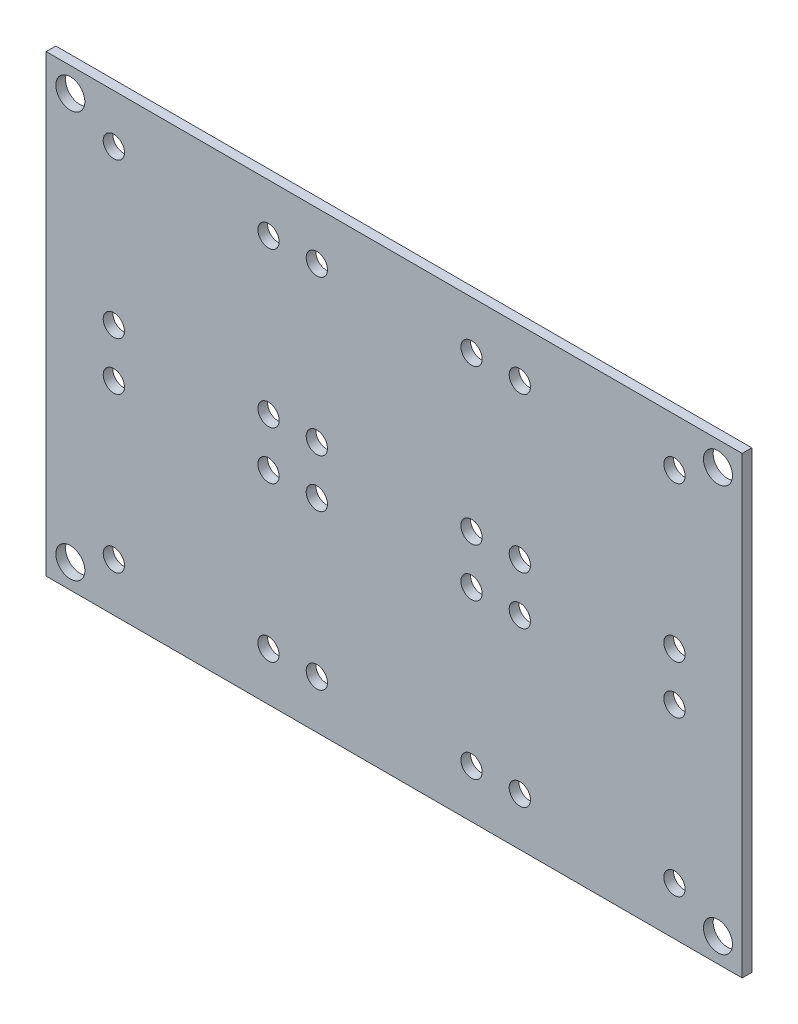
ISO-10303-21;
HEADER;
FILE_DESCRIPTION(('STEP AP214'),'2;1');
FILE_NAME('part.step','',(''),(''),'','','');
FILE_SCHEMA(('AUTOMOTIVE_DESIGN { 1 0 10303 214 1 1 1 1 }'));
ENDSEC;
DATA;
#1=APPLICATION_CONTEXT('core data for automotive mechanical design processes');
#2=APPLICATION_PROTOCOL_DEFINITION('international standard','automotive_design',2000,#1);
#3=PRODUCT_CONTEXT('',#1,'mechanical');
#4=PRODUCT('Part','Part','',(#3));
#5=PRODUCT_RELATED_PRODUCT_CATEGORY('part','',(#4));
#6=PRODUCT_DEFINITION_FORMATION('','',#4);
#7=PRODUCT_DEFINITION_CONTEXT('part definition',#1,'design');
#8=PRODUCT_DEFINITION('design','',#6,#7);
#9=PRODUCT_DEFINITION_SHAPE('','',#8);
#10=(LENGTH_UNIT() NAMED_UNIT(*) SI_UNIT(.MILLI.,.METRE.));
#11=(NAMED_UNIT(*) PLANE_ANGLE_UNIT() SI_UNIT($,.RADIAN.));
#12=(NAMED_UNIT(*) SI_UNIT($,.STERADIAN.) SOLID_ANGLE_UNIT());
#13=UNCERTAINTY_MEASURE_WITH_UNIT(LENGTH_MEASURE(1.E-05),#10,'distance_accuracy_value','');
#14=(GEOMETRIC_REPRESENTATION_CONTEXT(3) GLOBAL_UNCERTAINTY_ASSIGNED_CONTEXT((#13)) GLOBAL_UNIT_ASSIGNED_CONTEXT((#10,
#11,#12)) REPRESENTATION_CONTEXT('',''));
#15=CARTESIAN_POINT('',(0.,0.,0.));
#16=DIRECTION('',(0.,0.,1.));
#17=DIRECTION('',(1.,0.,0.));
#18=AXIS2_PLACEMENT_3D('',#15,#16,#17);
#19=CARTESIAN_POINT('',(-78.4654545454545,41.4428806133625,1.00000000000004));
#20=DIRECTION('',(1.,0.,0.));
#21=DIRECTION('',(0.,1.,0.));
#22=AXIS2_PLACEMENT_3D('',#19,#20,#21);
#23=PLANE('',#22);
#24=DIRECTION('',(0.,-1.,0.));
#25=VECTOR('',#24,1.);
#26=CARTESIAN_POINT('',(-78.4654545454545,41.4428806133625,0.));
#27=LINE('',#26,#25);
#28=CARTESIAN_POINT('',(-78.4654545454545,41.4428806133625,0.));
#29=VERTEX_POINT('',#28);
#30=CARTESIAN_POINT('',(-78.4654545454545,-5.55711938663746,0.));
#31=VERTEX_POINT('',#30);
#32=EDGE_CURVE('E96',#29,#31,#27,.T.);
#33=ORIENTED_EDGE('',*,*,#32,.T.);
#34=DIRECTION('',(0.,0.,-1.));
#35=VECTOR('',#34,1.);
#36=CARTESIAN_POINT('',(-78.4654545454545,-5.55711938663746,1.00000000000004));
#37=LINE('',#36,#35);
#38=CARTESIAN_POINT('',(-78.4654545454545,-5.55711938663746,1.00000000000004));
#39=VERTEX_POINT('',#38);
#40=EDGE_CURVE('E11',#39,#31,#37,.T.);
#41=ORIENTED_EDGE('',*,*,#40,.F.);
#42=DIRECTION('',(0.,-1.,0.));
#43=VECTOR('',#42,1.);
#44=CARTESIAN_POINT('',(-78.4654545454545,41.4428806133625,1.00000000000004));
#45=LINE('',#44,#43);
#46=CARTESIAN_POINT('',(-78.4654545454545,41.4428806133625,1.00000000000004));
#47=VERTEX_POINT('',#46);
#48=EDGE_CURVE('E84',#47,#39,#45,.T.);
#49=ORIENTED_EDGE('',*,*,#48,.F.);
#50=DIRECTION('',(0.,0.,-1.));
#51=VECTOR('',#50,1.);
#52=CARTESIAN_POINT('',(-78.4654545454545,41.4428806133625,1.00000000000004));
#53=LINE('',#52,#51);
#54=EDGE_CURVE('E92',#47,#29,#53,.T.);
#55=ORIENTED_EDGE('',*,*,#54,.T.);
#56=EDGE_LOOP('',(#33,#41,#49,#55));
#57=FACE_BOUND('',#56,.T.);
#58=ADVANCED_FACE('F33',(#57),#23,.F.);
#59=CARTESIAN_POINT('',(-78.4654545454545,-5.55711938663746,1.00000000000004));
#60=DIRECTION('',(0.,1.,0.));
#61=DIRECTION('',(0.,0.,1.));
#62=AXIS2_PLACEMENT_3D('',#59,#60,#61);
#63=PLANE('',#62);
#64=DIRECTION('',(1.,0.,0.));
#65=VECTOR('',#64,1.);
#66=CARTESIAN_POINT('',(-78.4654545454545,-5.55711938663746,0.));
#67=LINE('',#66,#65);
#68=CARTESIAN_POINT('',(-6.46545454545452,-5.55711938663746,0.));
#69=VERTEX_POINT('',#68);
#70=EDGE_CURVE('E88',#31,#69,#67,.T.);
#71=ORIENTED_EDGE('',*,*,#70,.T.);
#72=DIRECTION('',(0.,0.,-1.));
#73=VECTOR('',#72,1.);
#74=CARTESIAN_POINT('',(-6.46545454545452,-5.55711938663746,1.00000000000004));
#75=LINE('',#74,#73);
#76=CARTESIAN_POINT('',(-6.46545454545452,-5.55711938663746,1.00000000000004));
#77=VERTEX_POINT('',#76);
#78=EDGE_CURVE('E41',#77,#69,#75,.T.);
#79=ORIENTED_EDGE('',*,*,#78,.F.);
#80=DIRECTION('',(1.,0.,0.));
#81=VECTOR('',#80,1.);
#82=CARTESIAN_POINT('',(-78.4654545454545,-5.55711938663746,1.00000000000004));
#83=LINE('',#82,#81);
#84=EDGE_CURVE('E79',#39,#77,#83,.T.);
#85=ORIENTED_EDGE('',*,*,#84,.F.);
#86=ORIENTED_EDGE('',*,*,#40,.T.);
#87=EDGE_LOOP('',(#71,#79,#85,#86));
#88=FACE_BOUND('',#87,.T.);
#89=ADVANCED_FACE('F87',(#88),#63,.F.);
#90=CARTESIAN_POINT('',(-6.46545454545452,41.4428806133625,1.00000000000004));
#91=DIRECTION('',(-1.,0.,0.));
#92=DIRECTION('',(0.,0.,1.));
#93=AXIS2_PLACEMENT_3D('',#90,#91,#92);
#94=PLANE('',#93);
#95=DIRECTION('',(0.,1.,0.));
#96=VECTOR('',#95,1.);
#97=CARTESIAN_POINT('',(-6.46545454545452,41.4428806133625,0.));
#98=LINE('',#97,#96);
#99=CARTESIAN_POINT('',(-6.46545454545452,41.4428806133625,0.));
#100=VERTEX_POINT('',#99);
#101=EDGE_CURVE('E66',#69,#100,#98,.T.);
#102=ORIENTED_EDGE('',*,*,#101,.T.);
#103=DIRECTION('',(0.,0.,-1.));
#104=VECTOR('',#103,1.);
#105=CARTESIAN_POINT('',(-6.46545454545452,41.4428806133625,1.00000000000004));
#106=LINE('',#105,#104);
#107=CARTESIAN_POINT('',(-6.46545454545452,41.4428806133625,1.00000000000004));
#108=VERTEX_POINT('',#107);
#109=EDGE_CURVE('E89',#108,#100,#106,.T.);
#110=ORIENTED_EDGE('',*,*,#109,.F.);
#111=DIRECTION('',(0.,1.,0.));
#112=VECTOR('',#111,1.);
#113=CARTESIAN_POINT('',(-6.46545454545452,41.4428806133625,1.00000000000004));
#114=LINE('',#113,#112);
#115=EDGE_CURVE('E82',#77,#108,#114,.T.);
#116=ORIENTED_EDGE('',*,*,#115,.F.);
#117=ORIENTED_EDGE('',*,*,#78,.T.);
#118=EDGE_LOOP('',(#102,#110,#116,#117));
#119=FACE_BOUND('',#118,.T.);
#120=ADVANCED_FACE('F90',(#119),#94,.F.);
#121=CARTESIAN_POINT('',(-78.4654545454545,41.4428806133625,1.00000000000004));
#122=DIRECTION('',(0.,-1.,0.));
#123=DIRECTION('',(0.,0.,-1.));
#124=AXIS2_PLACEMENT_3D('',#121,#122,#123);
#125=PLANE('',#124);
#126=DIRECTION('',(-1.,0.,0.));
#127=VECTOR('',#126,1.);
#128=CARTESIAN_POINT('',(-78.4654545454545,41.4428806133625,0.));
#129=LINE('',#128,#127);
#130=EDGE_CURVE('E72',#100,#29,#129,.T.);
#131=ORIENTED_EDGE('',*,*,#130,.T.);
#132=ORIENTED_EDGE('',*,*,#54,.F.);
#133=DIRECTION('',(-1.,0.,0.));
#134=VECTOR('',#133,1.);
#135=CARTESIAN_POINT('',(-78.4654545454545,41.4428806133625,1.00000000000004));
#136=LINE('',#135,#134);
#137=EDGE_CURVE('E49',#108,#47,#136,.T.);
#138=ORIENTED_EDGE('',*,*,#137,.F.);
#139=ORIENTED_EDGE('',*,*,#109,.T.);
#140=EDGE_LOOP('',(#131,#132,#138,#139));
#141=FACE_BOUND('',#140,.T.);
#142=ADVANCED_FACE('F104',(#141),#125,.F.);
#143=CARTESIAN_POINT('',(-6.46545454545452,-5.55711938663746,1.00000000000004));
#144=DIRECTION('',(0.,0.,1.));
#145=DIRECTION('',(1.,0.,0.));
#146=AXIS2_PLACEMENT_3D('',#143,#144,#145);
#147=PLANE('',#146);
#148=CARTESIAN_POINT('',(-71.4654545454543,15.4428806133625,1.00000000000004));
#149=DIRECTION('',(0.,0.,1.));
#150=DIRECTION('',(1.,0.,0.));
#151=AXIS2_PLACEMENT_3D('',#148,#149,#150);
#152=CIRCLE('',#151,1.10000000000001);
#153=CARTESIAN_POINT('',(-70.3654545454543,15.4428806133625,1.00000000000004));
#154=VERTEX_POINT('',#153);
#155=EDGE_CURVE('E200',#154,#154,#152,.T.);
#156=ORIENTED_EDGE('',*,*,#155,.F.);
#157=EDGE_LOOP('',(#156));
#158=FACE_BOUND('',#157,.T.);
#159=CARTESIAN_POINT('',(-13.4654545454543,20.4428806133625,1.00000000000004));
#160=DIRECTION('',(0.,0.,1.));
#161=DIRECTION('',(1.,0.,0.));
#162=AXIS2_PLACEMENT_3D('',#159,#160,#161);
#163=CIRCLE('',#162,1.10000000000001);
#164=CARTESIAN_POINT('',(-12.3654545454543,20.4428806133625,1.00000000000004));
#165=VERTEX_POINT('',#164);
#166=EDGE_CURVE('E207',#165,#165,#163,.T.);
#167=ORIENTED_EDGE('',*,*,#166,.F.);
#168=EDGE_LOOP('',(#167));
#169=FACE_BOUND('',#168,.T.);
#170=CARTESIAN_POINT('',(-29.4654545454543,20.4428806133625,1.00000000000004));
#171=DIRECTION('',(0.,0.,1.));
#172=DIRECTION('',(1.,0.,0.));
#173=AXIS2_PLACEMENT_3D('',#170,#171,#172);
#174=CIRCLE('',#173,1.10000000000001);
#175=CARTESIAN_POINT('',(-28.3654545454543,20.4428806133625,1.00000000000004));
#176=VERTEX_POINT('',#175);
#177=EDGE_CURVE('E188',#176,#176,#174,.T.);
#178=ORIENTED_EDGE('',*,*,#177,.F.);
#179=EDGE_LOOP('',(#178));
#180=FACE_BOUND('',#179,.T.);
#181=CARTESIAN_POINT('',(-34.4654545454543,20.4428806133625,1.00000000000004));
#182=DIRECTION('',(0.,0.,1.));
#183=DIRECTION('',(1.,0.,0.));
#184=AXIS2_PLACEMENT_3D('',#181,#182,#183);
#185=CIRCLE('',#184,1.10000000000001);
#186=CARTESIAN_POINT('',(-33.3654545454543,20.4428806133625,1.00000000000004));
#187=VERTEX_POINT('',#186);
#188=EDGE_CURVE('E195',#187,#187,#185,.T.);
#189=ORIENTED_EDGE('',*,*,#188,.F.);
#190=EDGE_LOOP('',(#189));
#191=FACE_BOUND('',#190,.T.);
#192=CARTESIAN_POINT('',(-50.4654545454543,15.4428806133625,1.00000000000004));
#193=DIRECTION('',(0.,0.,1.));
#194=DIRECTION('',(1.,0.,0.));
#195=AXIS2_PLACEMENT_3D('',#192,#193,#194);
#196=CIRCLE('',#195,1.10000000000001);
#197=CARTESIAN_POINT('',(-49.3654545454543,15.4428806133625,1.00000000000004));
#198=VERTEX_POINT('',#197);
#199=EDGE_CURVE('E224',#198,#198,#196,.T.);
#200=ORIENTED_EDGE('',*,*,#199,.F.);
#201=EDGE_LOOP('',(#200));
#202=FACE_BOUND('',#201,.T.);
#203=CARTESIAN_POINT('',(-55.4654545454541,-0.557119386637463,1.00000000000004));
#204=DIRECTION('',(0.,0.,1.));
#205=DIRECTION('',(1.,0.,0.));
#206=AXIS2_PLACEMENT_3D('',#203,#204,#205);
#207=CIRCLE('',#206,1.10000000000001);
#208=CARTESIAN_POINT('',(-54.3654545454541,-0.557119386637463,1.00000000000004));
#209=VERTEX_POINT('',#208);
#210=EDGE_CURVE('E231',#209,#209,#207,.T.);
#211=ORIENTED_EDGE('',*,*,#210,.F.);
#212=EDGE_LOOP('',(#211));
#213=FACE_BOUND('',#212,.T.);
#214=CARTESIAN_POINT('',(-71.4654545454541,-0.557119386637463,1.00000000000004));
#215=DIRECTION('',(0.,0.,1.));
#216=DIRECTION('',(1.,0.,0.));
#217=AXIS2_PLACEMENT_3D('',#214,#215,#216);
#218=CIRCLE('',#217,1.10000000000001);
#219=CARTESIAN_POINT('',(-70.3654545454541,-0.557119386637463,1.00000000000004));
#220=VERTEX_POINT('',#219);
#221=EDGE_CURVE('E212',#220,#220,#218,.T.);
#222=ORIENTED_EDGE('',*,*,#221,.F.);
#223=EDGE_LOOP('',(#222));
#224=FACE_BOUND('',#223,.T.);
#225=CARTESIAN_POINT('',(-55.4654545454543,15.4428806133625,1.00000000000004));
#226=DIRECTION('',(0.,0.,1.));
#227=DIRECTION('',(1.,0.,0.));
#228=AXIS2_PLACEMENT_3D('',#225,#226,#227);
#229=CIRCLE('',#228,1.10000000000001);
#230=CARTESIAN_POINT('',(-54.3654545454543,15.4428806133625,1.00000000000004));
#231=VERTEX_POINT('',#230);
#232=EDGE_CURVE('E219',#231,#231,#229,.T.);
#233=ORIENTED_EDGE('',*,*,#232,.F.);
#234=EDGE_LOOP('',(#233));
#235=FACE_BOUND('',#234,.T.);
#236=CARTESIAN_POINT('',(-50.4654545454545,36.4428806133625,1.00000000000004));
#237=DIRECTION('',(0.,0.,1.));
#238=DIRECTION('',(1.,0.,0.));
#239=AXIS2_PLACEMENT_3D('',#236,#237,#238);
#240=CIRCLE('',#239,1.10000000000001);
#241=CARTESIAN_POINT('',(-49.3654545454545,36.4428806133625,1.00000000000004));
#242=VERTEX_POINT('',#241);
#243=EDGE_CURVE('E152',#242,#242,#240,.T.);
#244=ORIENTED_EDGE('',*,*,#243,.F.);
#245=EDGE_LOOP('',(#244));
#246=FACE_BOUND('',#245,.T.);
#247=CARTESIAN_POINT('',(-55.4654545454543,20.4428806133625,1.00000000000004));
#248=DIRECTION('',(0.,0.,1.));
#249=DIRECTION('',(1.,0.,0.));
#250=AXIS2_PLACEMENT_3D('',#247,#248,#249);
#251=CIRCLE('',#250,1.10000000000001);
#252=CARTESIAN_POINT('',(-54.3654545454543,20.4428806133625,1.00000000000004));
#253=VERTEX_POINT('',#252);
#254=EDGE_CURVE('E159',#253,#253,#251,.T.);
#255=ORIENTED_EDGE('',*,*,#254,.F.);
#256=EDGE_LOOP('',(#255));
#257=FACE_BOUND('',#256,.T.);
#258=CARTESIAN_POINT('',(-71.4654545454543,20.4428806133625,1.00000000000004));
#259=DIRECTION('',(0.,0.,1.));
#260=DIRECTION('',(1.,0.,0.));
#261=AXIS2_PLACEMENT_3D('',#258,#259,#260);
#262=CIRCLE('',#261,1.10000000000001);
#263=CARTESIAN_POINT('',(-70.3654545454543,20.4428806133625,1.00000000000004));
#264=VERTEX_POINT('',#263);
#265=EDGE_CURVE('E140',#264,#264,#262,.T.);
#266=ORIENTED_EDGE('',*,*,#265,.F.);
#267=EDGE_LOOP('',(#266));
#268=FACE_BOUND('',#267,.T.);
#269=CARTESIAN_POINT('',(-55.4654545454545,36.4428806133625,1.00000000000004));
#270=DIRECTION('',(0.,0.,1.));
#271=DIRECTION('',(1.,0.,0.));
#272=AXIS2_PLACEMENT_3D('',#269,#270,#271);
#273=CIRCLE('',#272,1.10000000000001);
#274=CARTESIAN_POINT('',(-54.3654545454545,36.4428806133625,1.00000000000004));
#275=VERTEX_POINT('',#274);
#276=EDGE_CURVE('E147',#275,#275,#273,.T.);
#277=ORIENTED_EDGE('',*,*,#276,.F.);
#278=EDGE_LOOP('',(#277));
#279=FACE_BOUND('',#278,.T.);
#280=CARTESIAN_POINT('',(-50.4654545454543,20.4428806133625,1.00000000000004));
#281=DIRECTION('',(0.,0.,1.));
#282=DIRECTION('',(1.,0.,0.));
#283=AXIS2_PLACEMENT_3D('',#280,#281,#282);
#284=CIRCLE('',#283,1.10000000000001);
#285=CARTESIAN_POINT('',(-49.3654545454543,20.4428806133625,1.00000000000004));
#286=VERTEX_POINT('',#285);
#287=EDGE_CURVE('E176',#286,#286,#284,.T.);
#288=ORIENTED_EDGE('',*,*,#287,.F.);
#289=EDGE_LOOP('',(#288));
#290=FACE_BOUND('',#289,.T.);
#291=CARTESIAN_POINT('',(-13.4654545454545,36.4428806133625,1.00000000000004));
#292=DIRECTION('',(0.,0.,1.));
#293=DIRECTION('',(1.,0.,0.));
#294=AXIS2_PLACEMENT_3D('',#291,#292,#293);
#295=CIRCLE('',#294,1.10000000000001);
#296=CARTESIAN_POINT('',(-12.3654545454545,36.4428806133625,1.00000000000004));
#297=VERTEX_POINT('',#296);
#298=EDGE_CURVE('E183',#297,#297,#295,.T.);
#299=ORIENTED_EDGE('',*,*,#298,.F.);
#300=EDGE_LOOP('',(#299));
#301=FACE_BOUND('',#300,.T.);
#302=CARTESIAN_POINT('',(-29.4654545454545,36.4428806133625,1.00000000000004));
#303=DIRECTION('',(0.,0.,1.));
#304=DIRECTION('',(1.,0.,0.));
#305=AXIS2_PLACEMENT_3D('',#302,#303,#304);
#306=CIRCLE('',#305,1.10000000000001);
#307=CARTESIAN_POINT('',(-28.3654545454545,36.4428806133625,1.00000000000004));
#308=VERTEX_POINT('',#307);
#309=EDGE_CURVE('E164',#308,#308,#306,.T.);
#310=ORIENTED_EDGE('',*,*,#309,.F.);
#311=EDGE_LOOP('',(#310));
#312=FACE_BOUND('',#311,.T.);
#313=CARTESIAN_POINT('',(-34.4654545454545,36.4428806133625,1.00000000000004));
#314=DIRECTION('',(0.,0.,1.));
#315=DIRECTION('',(1.,0.,0.));
#316=AXIS2_PLACEMENT_3D('',#313,#314,#315);
#317=CIRCLE('',#316,1.10000000000001);
#318=CARTESIAN_POINT('',(-33.3654545454545,36.4428806133625,1.00000000000004));
#319=VERTEX_POINT('',#318);
#320=EDGE_CURVE('E171',#319,#319,#317,.T.);
#321=ORIENTED_EDGE('',*,*,#320,.F.);
#322=EDGE_LOOP('',(#321));
#323=FACE_BOUND('',#322,.T.);
#324=CARTESIAN_POINT('',(-13.4654545454541,-0.557119386637463,1.00000000000004));
#325=DIRECTION('',(0.,0.,1.));
#326=DIRECTION('',(1.,0.,0.));
#327=AXIS2_PLACEMENT_3D('',#324,#325,#326);
#328=CIRCLE('',#327,1.10000000000001);
#329=CARTESIAN_POINT('',(-12.3654545454541,-0.557119386637463,1.00000000000004));
#330=VERTEX_POINT('',#329);
#331=EDGE_CURVE('E260',#330,#330,#328,.T.);
#332=ORIENTED_EDGE('',*,*,#331,.F.);
#333=EDGE_LOOP('',(#332));
#334=FACE_BOUND('',#333,.T.);
#335=CARTESIAN_POINT('',(-29.4654545454541,-0.557119386637463,1.00000000000004));
#336=DIRECTION('',(0.,0.,1.));
#337=DIRECTION('',(1.,0.,0.));
#338=AXIS2_PLACEMENT_3D('',#335,#336,#337);
#339=CIRCLE('',#338,1.10000000000001);
#340=CARTESIAN_POINT('',(-28.3654545454541,-0.557119386637463,1.00000000000004));
#341=VERTEX_POINT('',#340);
#342=EDGE_CURVE('E266',#341,#341,#339,.T.);
#343=ORIENTED_EDGE('',*,*,#342,.F.);
#344=EDGE_LOOP('',(#343));
#345=FACE_BOUND('',#344,.T.);
#346=CARTESIAN_POINT('',(-34.4654545454541,-0.557119386637463,1.00000000000004));
#347=DIRECTION('',(0.,0.,1.));
#348=DIRECTION('',(1.,0.,0.));
#349=AXIS2_PLACEMENT_3D('',#346,#347,#348);
#350=CIRCLE('',#349,1.10000000000001);
#351=CARTESIAN_POINT('',(-33.3654545454541,-0.557119386637463,1.00000000000004));
#352=VERTEX_POINT('',#351);
#353=EDGE_CURVE('E272',#352,#352,#350,.T.);
#354=ORIENTED_EDGE('',*,*,#353,.F.);
#355=EDGE_LOOP('',(#354));
#356=FACE_BOUND('',#355,.T.);
#357=CARTESIAN_POINT('',(-34.4654545454543,15.4428806133625,1.00000000000004));
#358=DIRECTION('',(0.,0.,1.));
#359=DIRECTION('',(1.,0.,0.));
#360=AXIS2_PLACEMENT_3D('',#357,#358,#359);
#361=CIRCLE('',#360,1.10000000000001);
#362=CARTESIAN_POINT('',(-33.3654545454543,15.4428806133625,1.00000000000004));
#363=VERTEX_POINT('',#362);
#364=EDGE_CURVE('E243',#363,#363,#361,.T.);
#365=ORIENTED_EDGE('',*,*,#364,.F.);
#366=EDGE_LOOP('',(#365));
#367=FACE_BOUND('',#366,.T.);
#368=CARTESIAN_POINT('',(-29.4654545454543,15.4428806133625,1.00000000000004));
#369=DIRECTION('',(0.,0.,1.));
#370=DIRECTION('',(1.,0.,0.));
#371=AXIS2_PLACEMENT_3D('',#368,#369,#370);
#372=CIRCLE('',#371,1.10000000000001);
#373=CARTESIAN_POINT('',(-28.3654545454543,15.4428806133625,1.00000000000004));
#374=VERTEX_POINT('',#373);
#375=EDGE_CURVE('E236',#374,#374,#372,.T.);
#376=ORIENTED_EDGE('',*,*,#375,.F.);
#377=EDGE_LOOP('',(#376));
#378=FACE_BOUND('',#377,.T.);
#379=CARTESIAN_POINT('',(-13.4654545454543,15.4428806133625,1.00000000000004));
#380=DIRECTION('',(0.,0.,1.));
#381=DIRECTION('',(1.,0.,0.));
#382=AXIS2_PLACEMENT_3D('',#379,#380,#381);
#383=CIRCLE('',#382,1.10000000000001);
#384=CARTESIAN_POINT('',(-12.3654545454543,15.4428806133625,1.00000000000004));
#385=VERTEX_POINT('',#384);
#386=EDGE_CURVE('E255',#385,#385,#383,.T.);
#387=ORIENTED_EDGE('',*,*,#386,.F.);
#388=EDGE_LOOP('',(#387));
#389=FACE_BOUND('',#388,.T.);
#390=CARTESIAN_POINT('',(-50.4654545454541,-0.557119386637463,1.00000000000004));
#391=DIRECTION('',(0.,0.,1.));
#392=DIRECTION('',(1.,0.,0.));
#393=AXIS2_PLACEMENT_3D('',#390,#391,#392);
#394=CIRCLE('',#393,1.10000000000001);
#395=CARTESIAN_POINT('',(-49.3654545454541,-0.557119386637463,1.00000000000004));
#396=VERTEX_POINT('',#395);
#397=EDGE_CURVE('E248',#396,#396,#394,.T.);
#398=ORIENTED_EDGE('',*,*,#397,.F.);
#399=EDGE_LOOP('',(#398));
#400=FACE_BOUND('',#399,.T.);
#401=CARTESIAN_POINT('',(-71.4654545454545,36.4428806133625,1.00000000000004));
#402=DIRECTION('',(0.,0.,1.));
#403=DIRECTION('',(1.,0.,0.));
#404=AXIS2_PLACEMENT_3D('',#401,#402,#403);
#405=CIRCLE('',#404,1.10000000000001);
#406=CARTESIAN_POINT('',(-70.3654545454545,36.4428806133625,1.00000000000004));
#407=VERTEX_POINT('',#406);
#408=EDGE_CURVE('E134',#407,#407,#405,.T.);
#409=ORIENTED_EDGE('',*,*,#408,.F.);
#410=EDGE_LOOP('',(#409));
#411=FACE_BOUND('',#410,.T.);
#412=CARTESIAN_POINT('',(-75.9654545454545,-3.05711938663746,1.00000000000004));
#413=DIRECTION('',(0.,0.,1.));
#414=DIRECTION('',(1.,0.,0.));
#415=AXIS2_PLACEMENT_3D('',#412,#413,#414);
#416=CIRCLE('',#415,1.5);
#417=CARTESIAN_POINT('',(-74.4654545454545,-3.05711938663746,1.00000000000004));
#418=VERTEX_POINT('',#417);
#419=EDGE_CURVE('E123',#418,#418,#416,.T.);
#420=ORIENTED_EDGE('',*,*,#419,.F.);
#421=EDGE_LOOP('',(#420));
#422=FACE_BOUND('',#421,.T.);
#423=CARTESIAN_POINT('',(-8.96545454545453,38.9428806133625,1.00000000000004));
#424=DIRECTION('',(0.,0.,1.));
#425=DIRECTION('',(1.,0.,0.));
#426=AXIS2_PLACEMENT_3D('',#423,#424,#425);
#427=CIRCLE('',#426,1.5);
#428=CARTESIAN_POINT('',(-7.46545454545452,38.9428806133625,1.00000000000004));
#429=VERTEX_POINT('',#428);
#430=EDGE_CURVE('E116',#429,#429,#427,.T.);
#431=ORIENTED_EDGE('',*,*,#430,.F.);
#432=EDGE_LOOP('',(#431));
#433=FACE_BOUND('',#432,.T.);
#434=CARTESIAN_POINT('',(-8.96545454545453,-3.05711938663746,1.00000000000004));
#435=DIRECTION('',(0.,0.,1.));
#436=DIRECTION('',(1.,0.,0.));
#437=AXIS2_PLACEMENT_3D('',#434,#435,#436);
#438=CIRCLE('',#437,1.5);
#439=CARTESIAN_POINT('',(-7.46545454545453,-3.05711938663746,1.00000000000004));
#440=VERTEX_POINT('',#439);
#441=EDGE_CURVE('E128',#440,#440,#438,.T.);
#442=ORIENTED_EDGE('',*,*,#441,.F.);
#443=EDGE_LOOP('',(#442));
#444=FACE_BOUND('',#443,.T.);
#445=CARTESIAN_POINT('',(-75.9654545454545,38.9428806133625,1.00000000000004));
#446=DIRECTION('',(0.,0.,1.));
#447=DIRECTION('',(1.,0.,0.));
#448=AXIS2_PLACEMENT_3D('',#445,#446,#447);
#449=CIRCLE('',#448,1.5);
#450=CARTESIAN_POINT('',(-74.4654545454545,38.9428806133625,1.00000000000004));
#451=VERTEX_POINT('',#450);
#452=EDGE_CURVE('E110',#451,#451,#449,.T.);
#453=ORIENTED_EDGE('',*,*,#452,.F.);
#454=EDGE_LOOP('',(#453));
#455=FACE_BOUND('',#454,.T.);
#456=ORIENTED_EDGE('',*,*,#48,.T.);
#457=ORIENTED_EDGE('',*,*,#84,.T.);
#458=ORIENTED_EDGE('',*,*,#115,.T.);
#459=ORIENTED_EDGE('',*,*,#137,.T.);
#460=EDGE_LOOP('',(#456,#457,#458,#459));
#461=FACE_BOUND('',#460,.T.);
#462=ADVANCED_FACE('F80',(#158,#169,#180,#191,#202,#213,#224,#235,#246,#257,#268,#279,#290,#301,
#312,#323,#334,#345,#356,#367,#378,#389,#400,#411,#422,#433,#444,#455,#461),#147,.T.);
#463=CARTESIAN_POINT('',(-6.46545454545452,-5.55711938663746,0.));
#464=DIRECTION('',(0.,0.,1.));
#465=DIRECTION('',(1.,0.,0.));
#466=AXIS2_PLACEMENT_3D('',#463,#464,#465);
#467=PLANE('',#466);
#468=CARTESIAN_POINT('',(-71.4654545454543,15.4428806133625,0.));
#469=DIRECTION('',(0.,0.,1.));
#470=DIRECTION('',(1.,0.,0.));
#471=AXIS2_PLACEMENT_3D('',#468,#469,#470);
#472=CIRCLE('',#471,1.10000000000001);
#473=CARTESIAN_POINT('',(-70.3654545454543,15.4428806133625,0.));
#474=VERTEX_POINT('',#473);
#475=EDGE_CURVE('E203',#474,#474,#472,.T.);
#476=ORIENTED_EDGE('',*,*,#475,.T.);
#477=EDGE_LOOP('',(#476));
#478=FACE_BOUND('',#477,.T.);
#479=CARTESIAN_POINT('',(-13.4654545454543,20.4428806133625,0.));
#480=DIRECTION('',(0.,0.,1.));
#481=DIRECTION('',(1.,0.,0.));
#482=AXIS2_PLACEMENT_3D('',#479,#480,#481);
#483=CIRCLE('',#482,1.10000000000001);
#484=CARTESIAN_POINT('',(-12.3654545454543,20.4428806133625,0.));
#485=VERTEX_POINT('',#484);
#486=EDGE_CURVE('E192',#485,#485,#483,.T.);
#487=ORIENTED_EDGE('',*,*,#486,.T.);
#488=EDGE_LOOP('',(#487));
#489=FACE_BOUND('',#488,.T.);
#490=CARTESIAN_POINT('',(-29.4654545454543,20.4428806133625,0.));
#491=DIRECTION('',(0.,0.,1.));
#492=DIRECTION('',(1.,0.,0.));
#493=AXIS2_PLACEMENT_3D('',#490,#491,#492);
#494=CIRCLE('',#493,1.10000000000001);
#495=CARTESIAN_POINT('',(-28.3654545454543,20.4428806133625,0.));
#496=VERTEX_POINT('',#495);
#497=EDGE_CURVE('E191',#496,#496,#494,.T.);
#498=ORIENTED_EDGE('',*,*,#497,.T.);
#499=EDGE_LOOP('',(#498));
#500=FACE_BOUND('',#499,.T.);
#501=CARTESIAN_POINT('',(-34.4654545454543,20.4428806133625,0.));
#502=DIRECTION('',(0.,0.,1.));
#503=DIRECTION('',(1.,0.,0.));
#504=AXIS2_PLACEMENT_3D('',#501,#502,#503);
#505=CIRCLE('',#504,1.10000000000001);
#506=CARTESIAN_POINT('',(-33.3654545454543,20.4428806133625,0.));
#507=VERTEX_POINT('',#506);
#508=EDGE_CURVE('E180',#507,#507,#505,.T.);
#509=ORIENTED_EDGE('',*,*,#508,.T.);
#510=EDGE_LOOP('',(#509));
#511=FACE_BOUND('',#510,.T.);
#512=CARTESIAN_POINT('',(-50.4654545454543,15.4428806133625,0.));
#513=DIRECTION('',(0.,0.,1.));
#514=DIRECTION('',(1.,0.,0.));
#515=AXIS2_PLACEMENT_3D('',#512,#513,#514);
#516=CIRCLE('',#515,1.10000000000001);
#517=CARTESIAN_POINT('',(-49.3654545454543,15.4428806133625,0.));
#518=VERTEX_POINT('',#517);
#519=EDGE_CURVE('E227',#518,#518,#516,.T.);
#520=ORIENTED_EDGE('',*,*,#519,.T.);
#521=EDGE_LOOP('',(#520));
#522=FACE_BOUND('',#521,.T.);
#523=CARTESIAN_POINT('',(-55.4654545454541,-0.557119386637463,0.));
#524=DIRECTION('',(0.,0.,1.));
#525=DIRECTION('',(1.,0.,0.));
#526=AXIS2_PLACEMENT_3D('',#523,#524,#525);
#527=CIRCLE('',#526,1.10000000000001);
#528=CARTESIAN_POINT('',(-54.3654545454541,-0.557119386637463,0.));
#529=VERTEX_POINT('',#528);
#530=EDGE_CURVE('E216',#529,#529,#527,.T.);
#531=ORIENTED_EDGE('',*,*,#530,.T.);
#532=EDGE_LOOP('',(#531));
#533=FACE_BOUND('',#532,.T.);
#534=CARTESIAN_POINT('',(-71.4654545454541,-0.557119386637463,0.));
#535=DIRECTION('',(0.,0.,1.));
#536=DIRECTION('',(1.,0.,0.));
#537=AXIS2_PLACEMENT_3D('',#534,#535,#536);
#538=CIRCLE('',#537,1.10000000000001);
#539=CARTESIAN_POINT('',(-70.3654545454541,-0.557119386637463,0.));
#540=VERTEX_POINT('',#539);
#541=EDGE_CURVE('E215',#540,#540,#538,.T.);
#542=ORIENTED_EDGE('',*,*,#541,.T.);
#543=EDGE_LOOP('',(#542));
#544=FACE_BOUND('',#543,.T.);
#545=CARTESIAN_POINT('',(-55.4654545454543,15.4428806133625,0.));
#546=DIRECTION('',(0.,0.,1.));
#547=DIRECTION('',(1.,0.,0.));
#548=AXIS2_PLACEMENT_3D('',#545,#546,#547);
#549=CIRCLE('',#548,1.10000000000001);
#550=CARTESIAN_POINT('',(-54.3654545454543,15.4428806133625,0.));
#551=VERTEX_POINT('',#550);
#552=EDGE_CURVE('E204',#551,#551,#549,.T.);
#553=ORIENTED_EDGE('',*,*,#552,.T.);
#554=EDGE_LOOP('',(#553));
#555=FACE_BOUND('',#554,.T.);
#556=CARTESIAN_POINT('',(-50.4654545454545,36.4428806133625,0.));
#557=DIRECTION('',(0.,0.,1.));
#558=DIRECTION('',(1.,0.,0.));
#559=AXIS2_PLACEMENT_3D('',#556,#557,#558);
#560=CIRCLE('',#559,1.10000000000001);
#561=CARTESIAN_POINT('',(-49.3654545454545,36.4428806133625,0.));
#562=VERTEX_POINT('',#561);
#563=EDGE_CURVE('E155',#562,#562,#560,.T.);
#564=ORIENTED_EDGE('',*,*,#563,.T.);
#565=EDGE_LOOP('',(#564));
#566=FACE_BOUND('',#565,.T.);
#567=CARTESIAN_POINT('',(-55.4654545454543,20.4428806133625,0.));
#568=DIRECTION('',(0.,0.,1.));
#569=DIRECTION('',(1.,0.,0.));
#570=AXIS2_PLACEMENT_3D('',#567,#568,#569);
#571=CIRCLE('',#570,1.10000000000001);
#572=CARTESIAN_POINT('',(-54.3654545454543,20.4428806133625,0.));
#573=VERTEX_POINT('',#572);
#574=EDGE_CURVE('E144',#573,#573,#571,.T.);
#575=ORIENTED_EDGE('',*,*,#574,.T.);
#576=EDGE_LOOP('',(#575));
#577=FACE_BOUND('',#576,.T.);
#578=CARTESIAN_POINT('',(-71.4654545454543,20.4428806133625,0.));
#579=DIRECTION('',(0.,0.,1.));
#580=DIRECTION('',(1.,0.,0.));
#581=AXIS2_PLACEMENT_3D('',#578,#579,#580);
#582=CIRCLE('',#581,1.10000000000001);
#583=CARTESIAN_POINT('',(-70.3654545454543,20.4428806133625,0.));
#584=VERTEX_POINT('',#583);
#585=EDGE_CURVE('E143',#584,#584,#582,.T.);
#586=ORIENTED_EDGE('',*,*,#585,.T.);
#587=EDGE_LOOP('',(#586));
#588=FACE_BOUND('',#587,.T.);
#589=CARTESIAN_POINT('',(-55.4654545454545,36.4428806133625,0.));
#590=DIRECTION('',(0.,0.,1.));
#591=DIRECTION('',(1.,0.,0.));
#592=AXIS2_PLACEMENT_3D('',#589,#590,#591);
#593=CIRCLE('',#592,1.10000000000001);
#594=CARTESIAN_POINT('',(-54.3654545454545,36.4428806133625,0.));
#595=VERTEX_POINT('',#594);
#596=EDGE_CURVE('E137',#595,#595,#593,.T.);
#597=ORIENTED_EDGE('',*,*,#596,.T.);
#598=EDGE_LOOP('',(#597));
#599=FACE_BOUND('',#598,.T.);
#600=CARTESIAN_POINT('',(-50.4654545454543,20.4428806133625,0.));
#601=DIRECTION('',(0.,0.,1.));
#602=DIRECTION('',(1.,0.,0.));
#603=AXIS2_PLACEMENT_3D('',#600,#601,#602);
#604=CIRCLE('',#603,1.10000000000001);
#605=CARTESIAN_POINT('',(-49.3654545454543,20.4428806133625,0.));
#606=VERTEX_POINT('',#605);
#607=EDGE_CURVE('E179',#606,#606,#604,.T.);
#608=ORIENTED_EDGE('',*,*,#607,.T.);
#609=EDGE_LOOP('',(#608));
#610=FACE_BOUND('',#609,.T.);
#611=CARTESIAN_POINT('',(-13.4654545454545,36.4428806133625,0.));
#612=DIRECTION('',(0.,0.,1.));
#613=DIRECTION('',(1.,0.,0.));
#614=AXIS2_PLACEMENT_3D('',#611,#612,#613);
#615=CIRCLE('',#614,1.10000000000001);
#616=CARTESIAN_POINT('',(-12.3654545454545,36.4428806133625,0.));
#617=VERTEX_POINT('',#616);
#618=EDGE_CURVE('E168',#617,#617,#615,.T.);
#619=ORIENTED_EDGE('',*,*,#618,.T.);
#620=EDGE_LOOP('',(#619));
#621=FACE_BOUND('',#620,.T.);
#622=CARTESIAN_POINT('',(-29.4654545454545,36.4428806133625,0.));
#623=DIRECTION('',(0.,0.,1.));
#624=DIRECTION('',(1.,0.,0.));
#625=AXIS2_PLACEMENT_3D('',#622,#623,#624);
#626=CIRCLE('',#625,1.10000000000001);
#627=CARTESIAN_POINT('',(-28.3654545454545,36.4428806133625,0.));
#628=VERTEX_POINT('',#627);
#629=EDGE_CURVE('E167',#628,#628,#626,.T.);
#630=ORIENTED_EDGE('',*,*,#629,.T.);
#631=EDGE_LOOP('',(#630));
#632=FACE_BOUND('',#631,.T.);
#633=CARTESIAN_POINT('',(-34.4654545454545,36.4428806133625,0.));
#634=DIRECTION('',(0.,0.,1.));
#635=DIRECTION('',(1.,0.,0.));
#636=AXIS2_PLACEMENT_3D('',#633,#634,#635);
#637=CIRCLE('',#636,1.10000000000001);
#638=CARTESIAN_POINT('',(-33.3654545454545,36.4428806133625,0.));
#639=VERTEX_POINT('',#638);
#640=EDGE_CURVE('E156',#639,#639,#637,.T.);
#641=ORIENTED_EDGE('',*,*,#640,.T.);
#642=EDGE_LOOP('',(#641));
#643=FACE_BOUND('',#642,.T.);
#644=CARTESIAN_POINT('',(-13.4654545454541,-0.557119386637463,0.));
#645=DIRECTION('',(0.,0.,1.));
#646=DIRECTION('',(1.,0.,0.));
#647=AXIS2_PLACEMENT_3D('',#644,#645,#646);
#648=CIRCLE('',#647,1.10000000000001);
#649=CARTESIAN_POINT('',(-12.3654545454541,-0.557119386637463,0.));
#650=VERTEX_POINT('',#649);
#651=EDGE_CURVE('E263',#650,#650,#648,.T.);
#652=ORIENTED_EDGE('',*,*,#651,.T.);
#653=EDGE_LOOP('',(#652));
#654=FACE_BOUND('',#653,.T.);
#655=CARTESIAN_POINT('',(-29.4654545454541,-0.557119386637463,0.));
#656=DIRECTION('',(0.,0.,1.));
#657=DIRECTION('',(1.,0.,0.));
#658=AXIS2_PLACEMENT_3D('',#655,#656,#657);
#659=CIRCLE('',#658,1.10000000000001);
#660=CARTESIAN_POINT('',(-28.3654545454541,-0.557119386637463,0.));
#661=VERTEX_POINT('',#660);
#662=EDGE_CURVE('E269',#661,#661,#659,.T.);
#663=ORIENTED_EDGE('',*,*,#662,.T.);
#664=EDGE_LOOP('',(#663));
#665=FACE_BOUND('',#664,.T.);
#666=CARTESIAN_POINT('',(-34.4654545454541,-0.557119386637463,0.));
#667=DIRECTION('',(0.,0.,1.));
#668=DIRECTION('',(1.,0.,0.));
#669=AXIS2_PLACEMENT_3D('',#666,#667,#668);
#670=CIRCLE('',#669,1.10000000000001);
#671=CARTESIAN_POINT('',(-33.3654545454541,-0.557119386637463,0.));
#672=VERTEX_POINT('',#671);
#673=EDGE_CURVE('E252',#672,#672,#670,.T.);
#674=ORIENTED_EDGE('',*,*,#673,.T.);
#675=EDGE_LOOP('',(#674));
#676=FACE_BOUND('',#675,.T.);
#677=CARTESIAN_POINT('',(-34.4654545454543,15.4428806133625,0.));
#678=DIRECTION('',(0.,0.,1.));
#679=DIRECTION('',(1.,0.,0.));
#680=AXIS2_PLACEMENT_3D('',#677,#678,#679);
#681=CIRCLE('',#680,1.10000000000001);
#682=CARTESIAN_POINT('',(-33.3654545454543,15.4428806133625,0.));
#683=VERTEX_POINT('',#682);
#684=EDGE_CURVE('E228',#683,#683,#681,.T.);
#685=ORIENTED_EDGE('',*,*,#684,.T.);
#686=EDGE_LOOP('',(#685));
#687=FACE_BOUND('',#686,.T.);
#688=CARTESIAN_POINT('',(-29.4654545454543,15.4428806133625,0.));
#689=DIRECTION('',(0.,0.,1.));
#690=DIRECTION('',(1.,0.,0.));
#691=AXIS2_PLACEMENT_3D('',#688,#689,#690);
#692=CIRCLE('',#691,1.10000000000001);
#693=CARTESIAN_POINT('',(-28.3654545454543,15.4428806133625,0.));
#694=VERTEX_POINT('',#693);
#695=EDGE_CURVE('E239',#694,#694,#692,.T.);
#696=ORIENTED_EDGE('',*,*,#695,.T.);
#697=EDGE_LOOP('',(#696));
#698=FACE_BOUND('',#697,.T.);
#699=CARTESIAN_POINT('',(-13.4654545454543,15.4428806133625,0.));
#700=DIRECTION('',(0.,0.,1.));
#701=DIRECTION('',(1.,0.,0.));
#702=AXIS2_PLACEMENT_3D('',#699,#700,#701);
#703=CIRCLE('',#702,1.10000000000001);
#704=CARTESIAN_POINT('',(-12.3654545454543,15.4428806133625,0.));
#705=VERTEX_POINT('',#704);
#706=EDGE_CURVE('E240',#705,#705,#703,.T.);
#707=ORIENTED_EDGE('',*,*,#706,.T.);
#708=EDGE_LOOP('',(#707));
#709=FACE_BOUND('',#708,.T.);
#710=CARTESIAN_POINT('',(-50.4654545454541,-0.557119386637463,0.));
#711=DIRECTION('',(0.,0.,1.));
#712=DIRECTION('',(1.,0.,0.));
#713=AXIS2_PLACEMENT_3D('',#710,#711,#712);
#714=CIRCLE('',#713,1.10000000000001);
#715=CARTESIAN_POINT('',(-49.3654545454541,-0.557119386637463,0.));
#716=VERTEX_POINT('',#715);
#717=EDGE_CURVE('E251',#716,#716,#714,.T.);
#718=ORIENTED_EDGE('',*,*,#717,.T.);
#719=EDGE_LOOP('',(#718));
#720=FACE_BOUND('',#719,.T.);
#721=CARTESIAN_POINT('',(-71.4654545454545,36.4428806133625,0.));
#722=DIRECTION('',(0.,0.,1.));
#723=DIRECTION('',(1.,0.,0.));
#724=AXIS2_PLACEMENT_3D('',#721,#722,#723);
#725=CIRCLE('',#724,1.10000000000001);
#726=CARTESIAN_POINT('',(-70.3654545454545,36.4428806133625,0.));
#727=VERTEX_POINT('',#726);
#728=EDGE_CURVE('E131',#727,#727,#725,.T.);
#729=ORIENTED_EDGE('',*,*,#728,.T.);
#730=EDGE_LOOP('',(#729));
#731=FACE_BOUND('',#730,.T.);
#732=CARTESIAN_POINT('',(-75.9654545454545,-3.05711938663746,0.));
#733=DIRECTION('',(0.,0.,1.));
#734=DIRECTION('',(1.,0.,0.));
#735=AXIS2_PLACEMENT_3D('',#732,#733,#734);
#736=CIRCLE('',#735,1.5);
#737=CARTESIAN_POINT('',(-74.4654545454545,-3.05711938663746,0.));
#738=VERTEX_POINT('',#737);
#739=EDGE_CURVE('E113',#738,#738,#736,.T.);
#740=ORIENTED_EDGE('',*,*,#739,.T.);
#741=EDGE_LOOP('',(#740));
#742=FACE_BOUND('',#741,.T.);
#743=CARTESIAN_POINT('',(-8.96545454545453,38.9428806133625,0.));
#744=DIRECTION('',(0.,0.,1.));
#745=DIRECTION('',(1.,0.,0.));
#746=AXIS2_PLACEMENT_3D('',#743,#744,#745);
#747=CIRCLE('',#746,1.5);
#748=CARTESIAN_POINT('',(-7.46545454545452,38.9428806133625,0.));
#749=VERTEX_POINT('',#748);
#750=EDGE_CURVE('E119',#749,#749,#747,.T.);
#751=ORIENTED_EDGE('',*,*,#750,.T.);
#752=EDGE_LOOP('',(#751));
#753=FACE_BOUND('',#752,.T.);
#754=CARTESIAN_POINT('',(-8.96545454545453,-3.05711938663746,0.));
#755=DIRECTION('',(0.,0.,1.));
#756=DIRECTION('',(1.,0.,0.));
#757=AXIS2_PLACEMENT_3D('',#754,#755,#756);
#758=CIRCLE('',#757,1.5);
#759=CARTESIAN_POINT('',(-7.46545454545453,-3.05711938663746,0.));
#760=VERTEX_POINT('',#759);
#761=EDGE_CURVE('E120',#760,#760,#758,.T.);
#762=ORIENTED_EDGE('',*,*,#761,.T.);
#763=EDGE_LOOP('',(#762));
#764=FACE_BOUND('',#763,.T.);
#765=CARTESIAN_POINT('',(-75.9654545454545,38.9428806133625,0.));
#766=DIRECTION('',(0.,0.,1.));
#767=DIRECTION('',(1.,0.,0.));
#768=AXIS2_PLACEMENT_3D('',#765,#766,#767);
#769=CIRCLE('',#768,1.5);
#770=CARTESIAN_POINT('',(-74.4654545454545,38.9428806133625,0.));
#771=VERTEX_POINT('',#770);
#772=EDGE_CURVE('E99',#771,#771,#769,.T.);
#773=ORIENTED_EDGE('',*,*,#772,.T.);
#774=EDGE_LOOP('',(#773));
#775=FACE_BOUND('',#774,.T.);
#776=ORIENTED_EDGE('',*,*,#32,.F.);
#777=ORIENTED_EDGE('',*,*,#130,.F.);
#778=ORIENTED_EDGE('',*,*,#101,.F.);
#779=ORIENTED_EDGE('',*,*,#70,.F.);
#780=EDGE_LOOP('',(#776,#777,#778,#779));
#781=FACE_BOUND('',#780,.T.);
#782=ADVANCED_FACE('F107',(#478,#489,#500,#511,#522,#533,#544,#555,#566,#577,#588,#599,#610,
#621,#632,#643,#654,#665,#676,#687,#698,#709,#720,#731,#742,#753,#764,#775,#781),#467,.F.);
#783=CARTESIAN_POINT('',(-75.9654545454545,38.9428806133625,0.));
#784=DIRECTION('',(0.,0.,1.));
#785=DIRECTION('',(1.,0.,0.));
#786=AXIS2_PLACEMENT_3D('',#783,#784,#785);
#787=CYLINDRICAL_SURFACE('',#786,1.5);
#788=ORIENTED_EDGE('',*,*,#772,.F.);
#789=EDGE_LOOP('',(#788));
#790=FACE_BOUND('',#789,.T.);
#791=ORIENTED_EDGE('',*,*,#452,.T.);
#792=EDGE_LOOP('',(#791));
#793=FACE_BOUND('',#792,.T.);
#794=ADVANCED_FACE('F310',(#790,#793),#787,.F.);
#795=CARTESIAN_POINT('',(-8.96545454545453,-3.05711938663746,0.));
#796=DIRECTION('',(0.,0.,1.));
#797=DIRECTION('',(1.,0.,0.));
#798=AXIS2_PLACEMENT_3D('',#795,#796,#797);
#799=CYLINDRICAL_SURFACE('',#798,1.5);
#800=ORIENTED_EDGE('',*,*,#761,.F.);
#801=EDGE_LOOP('',(#800));
#802=FACE_BOUND('',#801,.T.);
#803=ORIENTED_EDGE('',*,*,#441,.T.);
#804=EDGE_LOOP('',(#803));
#805=FACE_BOUND('',#804,.T.);
#806=ADVANCED_FACE('F312',(#802,#805),#799,.F.);
#807=CARTESIAN_POINT('',(-8.96545454545453,38.9428806133625,0.));
#808=DIRECTION('',(0.,0.,1.));
#809=DIRECTION('',(1.,0.,0.));
#810=AXIS2_PLACEMENT_3D('',#807,#808,#809);
#811=CYLINDRICAL_SURFACE('',#810,1.5);
#812=ORIENTED_EDGE('',*,*,#750,.F.);
#813=EDGE_LOOP('',(#812));
#814=FACE_BOUND('',#813,.T.);
#815=ORIENTED_EDGE('',*,*,#430,.T.);
#816=EDGE_LOOP('',(#815));
#817=FACE_BOUND('',#816,.T.);
#818=ADVANCED_FACE('F319',(#814,#817),#811,.F.);
#819=CARTESIAN_POINT('',(-75.9654545454545,-3.05711938663746,0.));
#820=DIRECTION('',(0.,0.,1.));
#821=DIRECTION('',(1.,0.,0.));
#822=AXIS2_PLACEMENT_3D('',#819,#820,#821);
#823=CYLINDRICAL_SURFACE('',#822,1.5);
#824=ORIENTED_EDGE('',*,*,#739,.F.);
#825=EDGE_LOOP('',(#824));
#826=FACE_BOUND('',#825,.T.);
#827=ORIENTED_EDGE('',*,*,#419,.T.);
#828=EDGE_LOOP('',(#827));
#829=FACE_BOUND('',#828,.T.);
#830=ADVANCED_FACE('F361',(#826,#829),#823,.F.);
#831=CARTESIAN_POINT('',(-71.4654545454545,36.4428806133625,0.));
#832=DIRECTION('',(0.,0.,1.));
#833=DIRECTION('',(1.,0.,0.));
#834=AXIS2_PLACEMENT_3D('',#831,#832,#833);
#835=CYLINDRICAL_SURFACE('',#834,1.10000000000001);
#836=ORIENTED_EDGE('',*,*,#728,.F.);
#837=EDGE_LOOP('',(#836));
#838=FACE_BOUND('',#837,.T.);
#839=ORIENTED_EDGE('',*,*,#408,.T.);
#840=EDGE_LOOP('',(#839));
#841=FACE_BOUND('',#840,.T.);
#842=ADVANCED_FACE('F355',(#838,#841),#835,.F.);
#843=CARTESIAN_POINT('',(-50.4654545454541,-0.557119386637463,0.));
#844=DIRECTION('',(0.,0.,1.));
#845=DIRECTION('',(1.,0.,0.));
#846=AXIS2_PLACEMENT_3D('',#843,#844,#845);
#847=CYLINDRICAL_SURFACE('',#846,1.10000000000001);
#848=ORIENTED_EDGE('',*,*,#717,.F.);
#849=EDGE_LOOP('',(#848));
#850=FACE_BOUND('',#849,.T.);
#851=ORIENTED_EDGE('',*,*,#397,.T.);
#852=EDGE_LOOP('',(#851));
#853=FACE_BOUND('',#852,.T.);
#854=ADVANCED_FACE('F360',(#850,#853),#847,.F.);
#855=CARTESIAN_POINT('',(-13.4654545454543,15.4428806133625,0.));
#856=DIRECTION('',(0.,0.,1.));
#857=DIRECTION('',(1.,0.,0.));
#858=AXIS2_PLACEMENT_3D('',#855,#856,#857);
#859=CYLINDRICAL_SURFACE('',#858,1.10000000000001);
#860=ORIENTED_EDGE('',*,*,#706,.F.);
#861=EDGE_LOOP('',(#860));
#862=FACE_BOUND('',#861,.T.);
#863=ORIENTED_EDGE('',*,*,#386,.T.);
#864=EDGE_LOOP('',(#863));
#865=FACE_BOUND('',#864,.T.);
#866=ADVANCED_FACE('F373',(#862,#865),#859,.F.);
#867=CARTESIAN_POINT('',(-29.4654545454543,15.4428806133625,0.));
#868=DIRECTION('',(0.,0.,1.));
#869=DIRECTION('',(1.,0.,0.));
#870=AXIS2_PLACEMENT_3D('',#867,#868,#869);
#871=CYLINDRICAL_SURFACE('',#870,1.10000000000001);
#872=ORIENTED_EDGE('',*,*,#695,.F.);
#873=EDGE_LOOP('',(#872));
#874=FACE_BOUND('',#873,.T.);
#875=ORIENTED_EDGE('',*,*,#375,.T.);
#876=EDGE_LOOP('',(#875));
#877=FACE_BOUND('',#876,.T.);
#878=ADVANCED_FACE('F383',(#874,#877),#871,.F.);
#879=CARTESIAN_POINT('',(-34.4654545454543,15.4428806133625,0.));
#880=DIRECTION('',(0.,0.,1.));
#881=DIRECTION('',(1.,0.,0.));
#882=AXIS2_PLACEMENT_3D('',#879,#880,#881);
#883=CYLINDRICAL_SURFACE('',#882,1.10000000000001);
#884=ORIENTED_EDGE('',*,*,#684,.F.);
#885=EDGE_LOOP('',(#884));
#886=FACE_BOUND('',#885,.T.);
#887=ORIENTED_EDGE('',*,*,#364,.T.);
#888=EDGE_LOOP('',(#887));
#889=FACE_BOUND('',#888,.T.);
#890=ADVANCED_FACE('F284',(#886,#889),#883,.F.);
#891=CARTESIAN_POINT('',(-34.4654545454541,-0.557119386637463,0.));
#892=DIRECTION('',(0.,0.,1.));
#893=DIRECTION('',(1.,0.,0.));
#894=AXIS2_PLACEMENT_3D('',#891,#892,#893);
#895=CYLINDRICAL_SURFACE('',#894,1.10000000000001);
#896=ORIENTED_EDGE('',*,*,#673,.F.);
#897=EDGE_LOOP('',(#896));
#898=FACE_BOUND('',#897,.T.);
#899=ORIENTED_EDGE('',*,*,#353,.T.);
#900=EDGE_LOOP('',(#899));
#901=FACE_BOUND('',#900,.T.);
#902=ADVANCED_FACE('F280',(#898,#901),#895,.F.);
#903=CARTESIAN_POINT('',(-29.4654545454541,-0.557119386637463,0.));
#904=DIRECTION('',(0.,0.,1.));
#905=DIRECTION('',(1.,0.,0.));
#906=AXIS2_PLACEMENT_3D('',#903,#904,#905);
#907=CYLINDRICAL_SURFACE('',#906,1.10000000000001);
#908=ORIENTED_EDGE('',*,*,#662,.F.);
#909=EDGE_LOOP('',(#908));
#910=FACE_BOUND('',#909,.T.);
#911=ORIENTED_EDGE('',*,*,#342,.T.);
#912=EDGE_LOOP('',(#911));
#913=FACE_BOUND('',#912,.T.);
#914=ADVANCED_FACE('F283',(#910,#913),#907,.F.);
#915=CARTESIAN_POINT('',(-13.4654545454541,-0.557119386637463,0.));
#916=DIRECTION('',(0.,0.,1.));
#917=DIRECTION('',(1.,0.,0.));
#918=AXIS2_PLACEMENT_3D('',#915,#916,#917);
#919=CYLINDRICAL_SURFACE('',#918,1.10000000000001);
#920=ORIENTED_EDGE('',*,*,#651,.F.);
#921=EDGE_LOOP('',(#920));
#922=FACE_BOUND('',#921,.T.);
#923=ORIENTED_EDGE('',*,*,#331,.T.);
#924=EDGE_LOOP('',(#923));
#925=FACE_BOUND('',#924,.T.);
#926=ADVANCED_FACE('F417',(#922,#925),#919,.F.);
#927=CARTESIAN_POINT('',(-34.4654545454545,36.4428806133625,0.));
#928=DIRECTION('',(0.,0.,1.));
#929=DIRECTION('',(1.,0.,0.));
#930=AXIS2_PLACEMENT_3D('',#927,#928,#929);
#931=CYLINDRICAL_SURFACE('',#930,1.10000000000001);
#932=ORIENTED_EDGE('',*,*,#640,.F.);
#933=EDGE_LOOP('',(#932));
#934=FACE_BOUND('',#933,.T.);
#935=ORIENTED_EDGE('',*,*,#320,.T.);
#936=EDGE_LOOP('',(#935));
#937=FACE_BOUND('',#936,.T.);
#938=ADVANCED_FACE('F427',(#934,#937),#931,.F.);
#939=CARTESIAN_POINT('',(-29.4654545454545,36.4428806133625,0.));
#940=DIRECTION('',(0.,0.,1.));
#941=DIRECTION('',(1.,0.,0.));
#942=AXIS2_PLACEMENT_3D('',#939,#940,#941);
#943=CYLINDRICAL_SURFACE('',#942,1.10000000000001);
#944=ORIENTED_EDGE('',*,*,#629,.F.);
#945=EDGE_LOOP('',(#944));
#946=FACE_BOUND('',#945,.T.);
#947=ORIENTED_EDGE('',*,*,#309,.T.);
#948=EDGE_LOOP('',(#947));
#949=FACE_BOUND('',#948,.T.);
#950=ADVANCED_FACE('F437',(#946,#949),#943,.F.);
#951=CARTESIAN_POINT('',(-13.4654545454545,36.4428806133625,0.));
#952=DIRECTION('',(0.,0.,1.));
#953=DIRECTION('',(1.,0.,0.));
#954=AXIS2_PLACEMENT_3D('',#951,#952,#953);
#955=CYLINDRICAL_SURFACE('',#954,1.10000000000001);
#956=ORIENTED_EDGE('',*,*,#618,.F.);
#957=EDGE_LOOP('',(#956));
#958=FACE_BOUND('',#957,.T.);
#959=ORIENTED_EDGE('',*,*,#298,.T.);
#960=EDGE_LOOP('',(#959));
#961=FACE_BOUND('',#960,.T.);
#962=ADVANCED_FACE('F447',(#958,#961),#955,.F.);
#963=CARTESIAN_POINT('',(-50.4654545454543,20.4428806133625,0.));
#964=DIRECTION('',(0.,0.,1.));
#965=DIRECTION('',(1.,0.,0.));
#966=AXIS2_PLACEMENT_3D('',#963,#964,#965);
#967=CYLINDRICAL_SURFACE('',#966,1.10000000000001);
#968=ORIENTED_EDGE('',*,*,#607,.F.);
#969=EDGE_LOOP('',(#968));
#970=FACE_BOUND('',#969,.T.);
#971=ORIENTED_EDGE('',*,*,#287,.T.);
#972=EDGE_LOOP('',(#971));
#973=FACE_BOUND('',#972,.T.);
#974=ADVANCED_FACE('F457',(#970,#973),#967,.F.);
#975=CARTESIAN_POINT('',(-55.4654545454545,36.4428806133625,0.));
#976=DIRECTION('',(0.,0.,1.));
#977=DIRECTION('',(1.,0.,0.));
#978=AXIS2_PLACEMENT_3D('',#975,#976,#977);
#979=CYLINDRICAL_SURFACE('',#978,1.10000000000001);
#980=ORIENTED_EDGE('',*,*,#596,.F.);
#981=EDGE_LOOP('',(#980));
#982=FACE_BOUND('',#981,.T.);
#983=ORIENTED_EDGE('',*,*,#276,.T.);
#984=EDGE_LOOP('',(#983));
#985=FACE_BOUND('',#984,.T.);
#986=ADVANCED_FACE('F467',(#982,#985),#979,.F.);
#987=CARTESIAN_POINT('',(-71.4654545454543,20.4428806133625,0.));
#988=DIRECTION('',(0.,0.,1.));
#989=DIRECTION('',(1.,0.,0.));
#990=AXIS2_PLACEMENT_3D('',#987,#988,#989);
#991=CYLINDRICAL_SURFACE('',#990,1.10000000000001);
#992=ORIENTED_EDGE('',*,*,#585,.F.);
#993=EDGE_LOOP('',(#992));
#994=FACE_BOUND('',#993,.T.);
#995=ORIENTED_EDGE('',*,*,#265,.T.);
#996=EDGE_LOOP('',(#995));
#997=FACE_BOUND('',#996,.T.);
#998=ADVANCED_FACE('F477',(#994,#997),#991,.F.);
#999=CARTESIAN_POINT('',(-55.4654545454543,20.4428806133625,0.));
#1000=DIRECTION('',(0.,0.,1.));
#1001=DIRECTION('',(1.,0.,0.));
#1002=AXIS2_PLACEMENT_3D('',#999,#1000,#1001);
#1003=CYLINDRICAL_SURFACE('',#1002,1.10000000000001);
#1004=ORIENTED_EDGE('',*,*,#574,.F.);
#1005=EDGE_LOOP('',(#1004));
#1006=FACE_BOUND('',#1005,.T.);
#1007=ORIENTED_EDGE('',*,*,#254,.T.);
#1008=EDGE_LOOP('',(#1007));
#1009=FACE_BOUND('',#1008,.T.);
#1010=ADVANCED_FACE('F487',(#1006,#1009),#1003,.F.);
#1011=CARTESIAN_POINT('',(-50.4654545454545,36.4428806133625,0.));
#1012=DIRECTION('',(0.,0.,1.));
#1013=DIRECTION('',(1.,0.,0.));
#1014=AXIS2_PLACEMENT_3D('',#1011,#1012,#1013);
#1015=CYLINDRICAL_SURFACE('',#1014,1.10000000000001);
#1016=ORIENTED_EDGE('',*,*,#563,.F.);
#1017=EDGE_LOOP('',(#1016));
#1018=FACE_BOUND('',#1017,.T.);
#1019=ORIENTED_EDGE('',*,*,#243,.T.);
#1020=EDGE_LOOP('',(#1019));
#1021=FACE_BOUND('',#1020,.T.);
#1022=ADVANCED_FACE('F497',(#1018,#1021),#1015,.F.);
#1023=CARTESIAN_POINT('',(-55.4654545454543,15.4428806133625,0.));
#1024=DIRECTION('',(0.,0.,1.));
#1025=DIRECTION('',(1.,0.,0.));
#1026=AXIS2_PLACEMENT_3D('',#1023,#1024,#1025);
#1027=CYLINDRICAL_SURFACE('',#1026,1.10000000000001);
#1028=ORIENTED_EDGE('',*,*,#552,.F.);
#1029=EDGE_LOOP('',(#1028));
#1030=FACE_BOUND('',#1029,.T.);
#1031=ORIENTED_EDGE('',*,*,#232,.T.);
#1032=EDGE_LOOP('',(#1031));
#1033=FACE_BOUND('',#1032,.T.);
#1034=ADVANCED_FACE('F507',(#1030,#1033),#1027,.F.);
#1035=CARTESIAN_POINT('',(-71.4654545454541,-0.557119386637463,0.));
#1036=DIRECTION('',(0.,0.,1.));
#1037=DIRECTION('',(1.,0.,0.));
#1038=AXIS2_PLACEMENT_3D('',#1035,#1036,#1037);
#1039=CYLINDRICAL_SURFACE('',#1038,1.10000000000001);
#1040=ORIENTED_EDGE('',*,*,#541,.F.);
#1041=EDGE_LOOP('',(#1040));
#1042=FACE_BOUND('',#1041,.T.);
#1043=ORIENTED_EDGE('',*,*,#221,.T.);
#1044=EDGE_LOOP('',(#1043));
#1045=FACE_BOUND('',#1044,.T.);
#1046=ADVANCED_FACE('F517',(#1042,#1045),#1039,.F.);
#1047=CARTESIAN_POINT('',(-55.4654545454541,-0.557119386637463,0.));
#1048=DIRECTION('',(0.,0.,1.));
#1049=DIRECTION('',(1.,0.,0.));
#1050=AXIS2_PLACEMENT_3D('',#1047,#1048,#1049);
#1051=CYLINDRICAL_SURFACE('',#1050,1.10000000000001);
#1052=ORIENTED_EDGE('',*,*,#530,.F.);
#1053=EDGE_LOOP('',(#1052));
#1054=FACE_BOUND('',#1053,.T.);
#1055=ORIENTED_EDGE('',*,*,#210,.T.);
#1056=EDGE_LOOP('',(#1055));
#1057=FACE_BOUND('',#1056,.T.);
#1058=ADVANCED_FACE('F527',(#1054,#1057),#1051,.F.);
#1059=CARTESIAN_POINT('',(-50.4654545454543,15.4428806133625,0.));
#1060=DIRECTION('',(0.,0.,1.));
#1061=DIRECTION('',(1.,0.,0.));
#1062=AXIS2_PLACEMENT_3D('',#1059,#1060,#1061);
#1063=CYLINDRICAL_SURFACE('',#1062,1.10000000000001);
#1064=ORIENTED_EDGE('',*,*,#519,.F.);
#1065=EDGE_LOOP('',(#1064));
#1066=FACE_BOUND('',#1065,.T.);
#1067=ORIENTED_EDGE('',*,*,#199,.T.);
#1068=EDGE_LOOP('',(#1067));
#1069=FACE_BOUND('',#1068,.T.);
#1070=ADVANCED_FACE('F537',(#1066,#1069),#1063,.F.);
#1071=CARTESIAN_POINT('',(-34.4654545454543,20.4428806133625,0.));
#1072=DIRECTION('',(0.,0.,1.));
#1073=DIRECTION('',(1.,0.,0.));
#1074=AXIS2_PLACEMENT_3D('',#1071,#1072,#1073);
#1075=CYLINDRICAL_SURFACE('',#1074,1.10000000000001);
#1076=ORIENTED_EDGE('',*,*,#508,.F.);
#1077=EDGE_LOOP('',(#1076));
#1078=FACE_BOUND('',#1077,.T.);
#1079=ORIENTED_EDGE('',*,*,#188,.T.);
#1080=EDGE_LOOP('',(#1079));
#1081=FACE_BOUND('',#1080,.T.);
#1082=ADVANCED_FACE('F547',(#1078,#1081),#1075,.F.);
#1083=CARTESIAN_POINT('',(-29.4654545454543,20.4428806133625,0.));
#1084=DIRECTION('',(0.,0.,1.));
#1085=DIRECTION('',(1.,0.,0.));
#1086=AXIS2_PLACEMENT_3D('',#1083,#1084,#1085);
#1087=CYLINDRICAL_SURFACE('',#1086,1.10000000000001);
#1088=ORIENTED_EDGE('',*,*,#497,.F.);
#1089=EDGE_LOOP('',(#1088));
#1090=FACE_BOUND('',#1089,.T.);
#1091=ORIENTED_EDGE('',*,*,#177,.T.);
#1092=EDGE_LOOP('',(#1091));
#1093=FACE_BOUND('',#1092,.T.);
#1094=ADVANCED_FACE('F557',(#1090,#1093),#1087,.F.);
#1095=CARTESIAN_POINT('',(-13.4654545454543,20.4428806133625,0.));
#1096=DIRECTION('',(0.,0.,1.));
#1097=DIRECTION('',(1.,0.,0.));
#1098=AXIS2_PLACEMENT_3D('',#1095,#1096,#1097);
#1099=CYLINDRICAL_SURFACE('',#1098,1.10000000000001);
#1100=ORIENTED_EDGE('',*,*,#486,.F.);
#1101=EDGE_LOOP('',(#1100));
#1102=FACE_BOUND('',#1101,.T.);
#1103=ORIENTED_EDGE('',*,*,#166,.T.);
#1104=EDGE_LOOP('',(#1103));
#1105=FACE_BOUND('',#1104,.T.);
#1106=ADVANCED_FACE('F567',(#1102,#1105),#1099,.F.);
#1107=CARTESIAN_POINT('',(-71.4654545454543,15.4428806133625,0.));
#1108=DIRECTION('',(0.,0.,1.));
#1109=DIRECTION('',(1.,0.,0.));
#1110=AXIS2_PLACEMENT_3D('',#1107,#1108,#1109);
#1111=CYLINDRICAL_SURFACE('',#1110,1.10000000000001);
#1112=ORIENTED_EDGE('',*,*,#475,.F.);
#1113=EDGE_LOOP('',(#1112));
#1114=FACE_BOUND('',#1113,.T.);
#1115=ORIENTED_EDGE('',*,*,#155,.T.);
#1116=EDGE_LOOP('',(#1115));
#1117=FACE_BOUND('',#1116,.T.);
#1118=ADVANCED_FACE('F577',(#1114,#1117),#1111,.F.);
#1119=CLOSED_SHELL('',(#58,#89,#120,#142,#462,#782,#794,#806,#818,#830,#842,#854,#866,#878,#890,
#902,#914,#926,#938,#950,#962,#974,#986,#998,#1010,#1022,#1034,#1046,#1058,#1070,#1082,#1094,
#1106,#1118));
#1120=MANIFOLD_SOLID_BREP('B2',#1119);
#1121=ADVANCED_BREP_SHAPE_REPRESENTATION('',(#18,#1120),#14);
#1122=SHAPE_DEFINITION_REPRESENTATION(#9,#1121);
ENDSEC;
END-ISO-10303-21;
